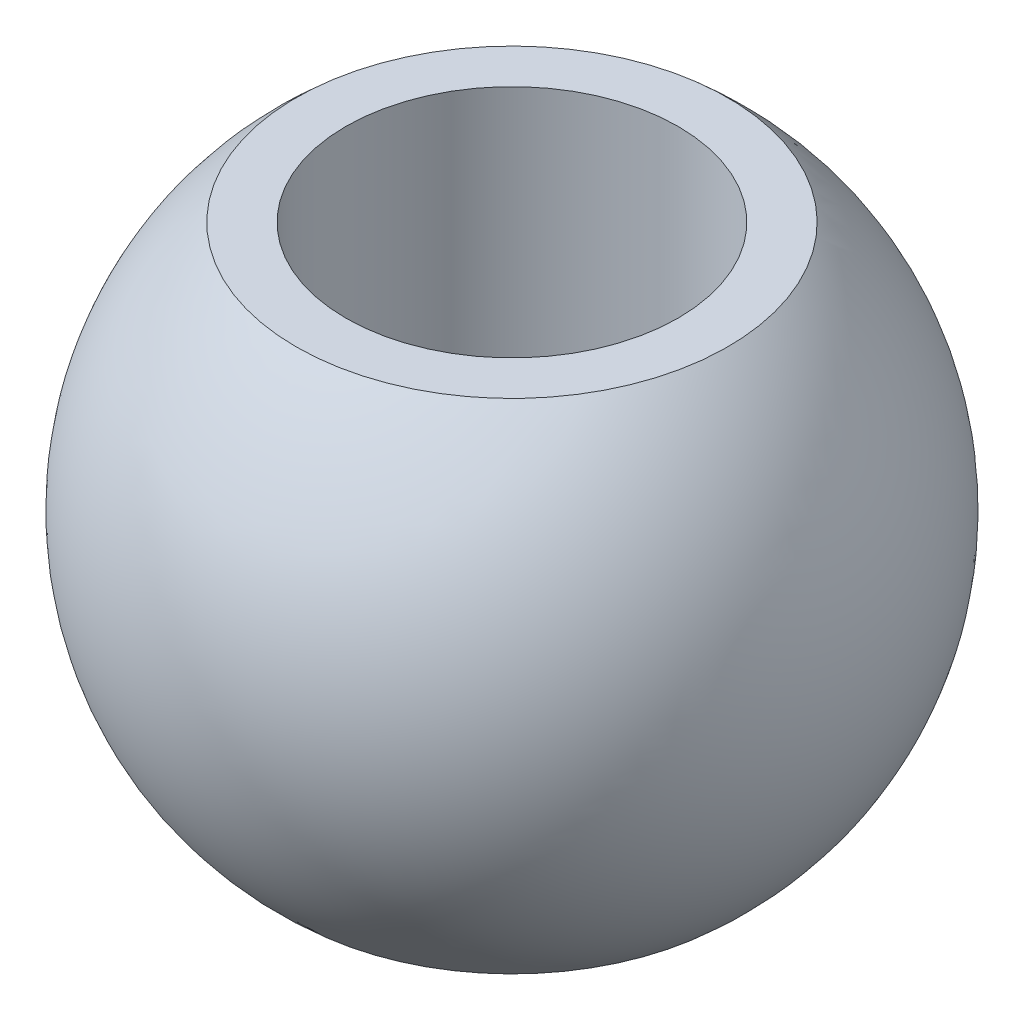
ISO-10303-21;
HEADER;
FILE_DESCRIPTION(('STEP AP214'),'2;1');
FILE_NAME('part.step','',(''),(''),'','','');
FILE_SCHEMA(('AUTOMOTIVE_DESIGN { 1 0 10303 214 1 1 1 1 }'));
ENDSEC;
DATA;
#1=APPLICATION_CONTEXT('core data for automotive mechanical design processes');
#2=APPLICATION_PROTOCOL_DEFINITION('international standard','automotive_design',2000,#1);
#3=PRODUCT_CONTEXT('',#1,'mechanical');
#4=PRODUCT('Part','Part','',(#3));
#5=PRODUCT_RELATED_PRODUCT_CATEGORY('part','',(#4));
#6=PRODUCT_DEFINITION_FORMATION('','',#4);
#7=PRODUCT_DEFINITION_CONTEXT('part definition',#1,'design');
#8=PRODUCT_DEFINITION('design','',#6,#7);
#9=PRODUCT_DEFINITION_SHAPE('','',#8);
#10=(LENGTH_UNIT() NAMED_UNIT(*) SI_UNIT(.MILLI.,.METRE.));
#11=(NAMED_UNIT(*) PLANE_ANGLE_UNIT() SI_UNIT($,.RADIAN.));
#12=(NAMED_UNIT(*) SI_UNIT($,.STERADIAN.) SOLID_ANGLE_UNIT());
#13=UNCERTAINTY_MEASURE_WITH_UNIT(LENGTH_MEASURE(1.E-05),#10,'distance_accuracy_value','');
#14=(GEOMETRIC_REPRESENTATION_CONTEXT(3) GLOBAL_UNCERTAINTY_ASSIGNED_CONTEXT((#13)) GLOBAL_UNIT_ASSIGNED_CONTEXT((#10,
#11,#12)) REPRESENTATION_CONTEXT('',''));
#15=CARTESIAN_POINT('',(0.,0.,0.));
#16=DIRECTION('',(0.,0.,1.));
#17=DIRECTION('',(1.,0.,0.));
#18=AXIS2_PLACEMENT_3D('',#15,#16,#17);
#19=CARTESIAN_POINT('',(0.,-7.9375,0.));
#20=DIRECTION('',(0.,1.,0.));
#21=DIRECTION('',(0.,0.,1.));
#22=AXIS2_PLACEMENT_3D('',#19,#20,#21);
#23=CYLINDRICAL_SURFACE('',#22,4.);
#24=CARTESIAN_POINT('',(0.,6.,0.));
#25=DIRECTION('',(0.,1.,0.));
#26=DIRECTION('',(0.,0.,1.));
#27=AXIS2_PLACEMENT_3D('',#24,#25,#26);
#28=CIRCLE('',#27,4.);
#29=CARTESIAN_POINT('',(0.,6.,4.));
#30=VERTEX_POINT('',#29);
#31=EDGE_CURVE('E78',#30,#30,#28,.F.);
#32=ORIENTED_EDGE('',*,*,#31,.F.);
#33=EDGE_LOOP('',(#32));
#34=FACE_BOUND('',#33,.T.);
#35=CARTESIAN_POINT('',(0.,-6.,0.));
#36=DIRECTION('',(0.,-1.,0.));
#37=DIRECTION('',(0.,0.,-1.));
#38=AXIS2_PLACEMENT_3D('',#35,#36,#37);
#39=CIRCLE('',#38,4.);
#40=CARTESIAN_POINT('',(0.,-6.,-4.));
#41=VERTEX_POINT('',#40);
#42=EDGE_CURVE('E41',#41,#41,#39,.F.);
#43=ORIENTED_EDGE('',*,*,#42,.F.);
#44=EDGE_LOOP('',(#43));
#45=FACE_BOUND('',#44,.T.);
#46=ADVANCED_FACE('F37',(#34,#45),#23,.F.);
#47=CARTESIAN_POINT('',(-7.9375,6.,7.9375));
#48=DIRECTION('',(0.,1.,0.));
#49=DIRECTION('',(0.,0.,1.));
#50=AXIS2_PLACEMENT_3D('',#47,#48,#49);
#51=PLANE('',#50);
#52=ORIENTED_EDGE('',*,*,#31,.T.);
#53=EDGE_LOOP('',(#52));
#54=FACE_BOUND('',#53,.T.);
#55=CARTESIAN_POINT('',(0.,6.,0.));
#56=DIRECTION('',(0.,1.,0.));
#57=DIRECTION('',(0.,0.,1.));
#58=AXIS2_PLACEMENT_3D('',#55,#56,#57);
#59=CIRCLE('',#58,5.19652828819395);
#60=CARTESIAN_POINT('',(0.,6.,5.19652828819395));
#61=VERTEX_POINT('',#60);
#62=EDGE_CURVE('E58',#61,#61,#59,.T.);
#63=ORIENTED_EDGE('',*,*,#62,.T.);
#64=EDGE_LOOP('',(#63));
#65=FACE_BOUND('',#64,.T.);
#66=ADVANCED_FACE('F62',(#54,#65),#51,.T.);
#67=CARTESIAN_POINT('',(-7.9375,-6.,7.9375));
#68=DIRECTION('',(0.,-1.,0.));
#69=DIRECTION('',(0.,0.,-1.));
#70=AXIS2_PLACEMENT_3D('',#67,#68,#69);
#71=PLANE('',#70);
#72=ORIENTED_EDGE('',*,*,#42,.T.);
#73=EDGE_LOOP('',(#72));
#74=FACE_BOUND('',#73,.T.);
#75=CARTESIAN_POINT('',(0.,-6.,0.));
#76=DIRECTION('',(0.,-1.,0.));
#77=DIRECTION('',(0.,0.,-1.));
#78=AXIS2_PLACEMENT_3D('',#75,#76,#77);
#79=CIRCLE('',#78,5.19652828819396);
#80=CARTESIAN_POINT('',(0.,-6.,-5.19652828819396));
#81=VERTEX_POINT('',#80);
#82=EDGE_CURVE('E11',#81,#81,#79,.T.);
#83=ORIENTED_EDGE('',*,*,#82,.T.);
#84=EDGE_LOOP('',(#83));
#85=FACE_BOUND('',#84,.T.);
#86=ADVANCED_FACE('F54',(#74,#85),#71,.T.);
#87=CARTESIAN_POINT('',(0.,0.,0.));
#88=DIRECTION('',(1.,0.,0.));
#89=DIRECTION('',(0.,0.,1.));
#90=AXIS2_PLACEMENT_3D('',#87,#88,#89);
#91=SPHERICAL_SURFACE('',#90,7.9375);
#92=CARTESIAN_POINT('',(0.,0.,-7.9375));
#93=VERTEX_POINT('',#92);
#94=VERTEX_LOOP('',#93);
#95=FACE_BOUND('',#94,.T.);
#96=CARTESIAN_POINT('',(0.,0.,7.9375));
#97=VERTEX_POINT('',#96);
#98=VERTEX_LOOP('',#97);
#99=FACE_BOUND('',#98,.T.);
#100=ORIENTED_EDGE('',*,*,#62,.F.);
#101=EDGE_LOOP('',(#100));
#102=FACE_BOUND('',#101,.T.);
#103=ORIENTED_EDGE('',*,*,#82,.F.);
#104=EDGE_LOOP('',(#103));
#105=FACE_BOUND('',#104,.T.);
#106=ADVANCED_FACE('F39',(#95,#99,#102,#105),#91,.T.);
#107=CLOSED_SHELL('',(#46,#66,#86,#106));
#108=MANIFOLD_SOLID_BREP('B2',#107);
#109=ADVANCED_BREP_SHAPE_REPRESENTATION('',(#18,#108),#14);
#110=SHAPE_DEFINITION_REPRESENTATION(#9,#109);
ENDSEC;
END-ISO-10303-21;
